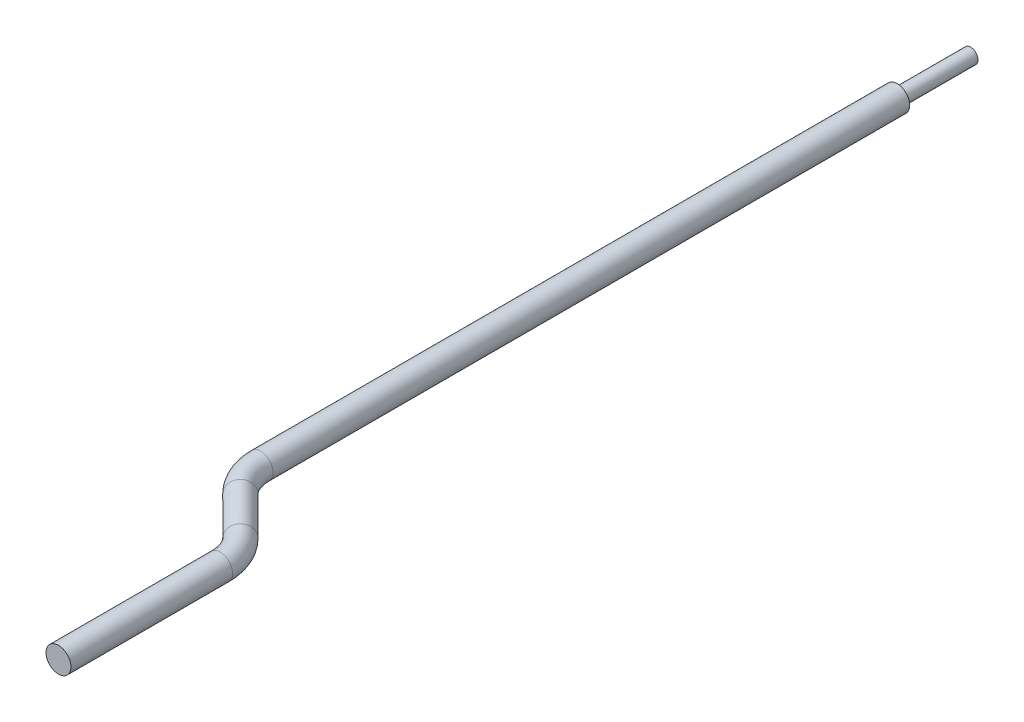
ISO-10303-21;
HEADER;
FILE_DESCRIPTION(('STEP AP214'),'2;1');
FILE_NAME('part.step','',(''),(''),'','','');
FILE_SCHEMA(('AUTOMOTIVE_DESIGN { 1 0 10303 214 1 1 1 1 }'));
ENDSEC;
DATA;
#1=APPLICATION_CONTEXT('core data for automotive mechanical design processes');
#2=APPLICATION_PROTOCOL_DEFINITION('international standard','automotive_design',2000,#1);
#3=PRODUCT_CONTEXT('',#1,'mechanical');
#4=PRODUCT('Part','Part','',(#3));
#5=PRODUCT_RELATED_PRODUCT_CATEGORY('part','',(#4));
#6=PRODUCT_DEFINITION_FORMATION('','',#4);
#7=PRODUCT_DEFINITION_CONTEXT('part definition',#1,'design');
#8=PRODUCT_DEFINITION('design','',#6,#7);
#9=PRODUCT_DEFINITION_SHAPE('','',#8);
#10=(LENGTH_UNIT() NAMED_UNIT(*) SI_UNIT(.MILLI.,.METRE.));
#11=(NAMED_UNIT(*) PLANE_ANGLE_UNIT() SI_UNIT($,.RADIAN.));
#12=(NAMED_UNIT(*) SI_UNIT($,.STERADIAN.) SOLID_ANGLE_UNIT());
#13=UNCERTAINTY_MEASURE_WITH_UNIT(LENGTH_MEASURE(1.E-05),#10,'distance_accuracy_value','');
#14=(GEOMETRIC_REPRESENTATION_CONTEXT(3) GLOBAL_UNCERTAINTY_ASSIGNED_CONTEXT((#13)) GLOBAL_UNIT_ASSIGNED_CONTEXT((#10,
#11,#12)) REPRESENTATION_CONTEXT('',''));
#15=CARTESIAN_POINT('',(0.,0.,0.));
#16=DIRECTION('',(0.,0.,1.));
#17=DIRECTION('',(1.,0.,0.));
#18=AXIS2_PLACEMENT_3D('',#15,#16,#17);
#19=CARTESIAN_POINT('',(0.,0.,35.56));
#20=DIRECTION('',(0.,0.,-1.));
#21=DIRECTION('',(-1.,0.,0.));
#22=AXIS2_PLACEMENT_3D('',#19,#20,#21);
#23=CYLINDRICAL_SURFACE('',#22,0.6477);
#24=CARTESIAN_POINT('',(0.,0.,36.83));
#25=DIRECTION('',(0.,0.,1.));
#26=DIRECTION('',(1.,0.,0.));
#27=AXIS2_PLACEMENT_3D('',#24,#25,#26);
#28=CIRCLE('',#27,0.6477);
#29=CARTESIAN_POINT('',(-0.647700000000005,0.,36.83));
#30=VERTEX_POINT('',#29);
#31=EDGE_CURVE('E49',#30,#30,#28,.T.);
#32=ORIENTED_EDGE('',*,*,#31,.F.);
#33=EDGE_LOOP('',(#32));
#34=FACE_BOUND('',#33,.T.);
#35=CARTESIAN_POINT('',(0.,0.,3.81));
#36=DIRECTION('',(0.,0.,-1.));
#37=DIRECTION('',(-1.,0.,0.));
#38=AXIS2_PLACEMENT_3D('',#35,#36,#37);
#39=CIRCLE('',#38,0.6477);
#40=CARTESIAN_POINT('',(-0.6477,0.,3.81));
#41=VERTEX_POINT('',#40);
#42=EDGE_CURVE('E56',#41,#41,#39,.T.);
#43=ORIENTED_EDGE('',*,*,#42,.F.);
#44=EDGE_LOOP('',(#43));
#45=FACE_BOUND('',#44,.T.);
#46=ADVANCED_FACE('F30',(#34,#45),#23,.T.);
#47=CARTESIAN_POINT('',(3.47980000000001,0.,42.4140048968553));
#48=DIRECTION('',(0.,0.,1.));
#49=DIRECTION('',(1.,0.,0.));
#50=AXIS2_PLACEMENT_3D('',#47,#48,#49);
#51=CYLINDRICAL_SURFACE('',#50,0.6477);
#52=CARTESIAN_POINT('',(3.47980000000001,0.,42.4140048968553));
#53=DIRECTION('',(0.,0.,1.));
#54=DIRECTION('',(1.,0.,0.));
#55=AXIS2_PLACEMENT_3D('',#52,#53,#54);
#56=CIRCLE('',#55,0.6477);
#57=CARTESIAN_POINT('',(4.1275,0.,42.4140048968553));
#58=VERTEX_POINT('',#57);
#59=EDGE_CURVE('E36',#58,#58,#56,.T.);
#60=ORIENTED_EDGE('',*,*,#59,.T.);
#61=EDGE_LOOP('',(#60));
#62=FACE_BOUND('',#61,.T.);
#63=CARTESIAN_POINT('',(3.4798,0.,50.8));
#64=DIRECTION('',(0.,0.,1.));
#65=DIRECTION('',(1.,0.,0.));
#66=AXIS2_PLACEMENT_3D('',#63,#64,#65);
#67=CIRCLE('',#66,0.6477);
#68=CARTESIAN_POINT('',(4.1275,0.,50.8));
#69=VERTEX_POINT('',#68);
#70=EDGE_CURVE('E10',#69,#69,#67,.T.);
#71=ORIENTED_EDGE('',*,*,#70,.F.);
#72=EDGE_LOOP('',(#71));
#73=FACE_BOUND('',#72,.T.);
#74=ADVANCED_FACE('F66',(#62,#73),#51,.T.);
#75=CARTESIAN_POINT('',(0.939800000000002,0.,42.4140048968553));
#76=DIRECTION('',(0.,-1.,0.));
#77=DIRECTION('',(0.,0.,-1.));
#78=AXIS2_PLACEMENT_3D('',#75,#76,#77);
#79=TOROIDAL_SURFACE('',#78,2.54,0.6477);
#80=CARTESIAN_POINT('',(2.73585122421383,0.,40.6179536726415));
#81=DIRECTION('',(0.707106781186549,0.,0.707106781186547));
#82=DIRECTION('',(0.707106781186547,0.,-0.707106781186549));
#83=AXIS2_PLACEMENT_3D('',#80,#81,#82);
#84=CIRCLE('',#83,0.6477);
#85=CARTESIAN_POINT('',(3.19384428638835,0.,40.159960610467));
#86=VERTEX_POINT('',#85);
#87=EDGE_CURVE('E40',#86,#86,#84,.T.);
#88=CARTESIAN_POINT('',(0.939800000000002,0.,42.4140048968553));
#89=DIRECTION('',(0.,-1.,0.));
#90=DIRECTION('',(0.,0.,-1.));
#91=AXIS2_PLACEMENT_3D('',#88,#89,#90);
#92=CIRCLE('',#91,3.1877);
#93=EDGE_CURVE('',#86,#58,#92,.T.);
#94=ORIENTED_EDGE('',*,*,#87,.T.);
#95=ORIENTED_EDGE('',*,*,#59,.F.);
#96=ORIENTED_EDGE('',*,*,#93,.T.);
#97=ORIENTED_EDGE('',*,*,#93,.F.);
#98=EDGE_LOOP('',(#94,#96,#95,#97));
#99=FACE_BOUND('',#98,.T.);
#100=ADVANCED_FACE('F71',(#99),#79,.T.);
#101=CARTESIAN_POINT('',(0.743948775786166,0.,38.6260512242138));
#102=DIRECTION('',(0.707106781186549,0.,0.707106781186546));
#103=DIRECTION('',(0.707106781186546,0.,-0.707106781186549));
#104=AXIS2_PLACEMENT_3D('',#101,#102,#103);
#105=CYLINDRICAL_SURFACE('',#104,0.6477);
#106=CARTESIAN_POINT('',(0.743948775786166,0.,38.6260512242138));
#107=DIRECTION('',(0.707106781186549,0.,0.707106781186547));
#108=DIRECTION('',(0.707106781186547,0.,-0.707106781186549));
#109=AXIS2_PLACEMENT_3D('',#106,#107,#108);
#110=CIRCLE('',#109,0.6477);
#111=CARTESIAN_POINT('',(0.28595571361164,0.,39.0840442863884));
#112=VERTEX_POINT('',#111);
#113=EDGE_CURVE('E44',#112,#112,#110,.T.);
#114=ORIENTED_EDGE('',*,*,#113,.T.);
#115=EDGE_LOOP('',(#114));
#116=FACE_BOUND('',#115,.T.);
#117=ORIENTED_EDGE('',*,*,#87,.F.);
#118=EDGE_LOOP('',(#117));
#119=FACE_BOUND('',#118,.T.);
#120=ADVANCED_FACE('F79',(#116,#119),#105,.T.);
#121=CARTESIAN_POINT('',(2.54,0.,36.83));
#122=DIRECTION('',(0.,1.,0.));
#123=DIRECTION('',(0.,0.,1.));
#124=AXIS2_PLACEMENT_3D('',#121,#122,#123);
#125=TOROIDAL_SURFACE('',#124,2.54,0.6477);
#126=CARTESIAN_POINT('',(2.54,0.,36.83));
#127=DIRECTION('',(0.,1.,0.));
#128=DIRECTION('',(0.,0.,1.));
#129=AXIS2_PLACEMENT_3D('',#126,#127,#128);
#130=CIRCLE('',#129,3.1877);
#131=EDGE_CURVE('',#30,#112,#130,.T.);
#132=ORIENTED_EDGE('',*,*,#31,.T.);
#133=ORIENTED_EDGE('',*,*,#113,.F.);
#134=ORIENTED_EDGE('',*,*,#131,.T.);
#135=ORIENTED_EDGE('',*,*,#131,.F.);
#136=EDGE_LOOP('',(#132,#134,#133,#135));
#137=FACE_BOUND('',#136,.T.);
#138=ADVANCED_FACE('F75',(#137),#125,.T.);
#139=CARTESIAN_POINT('',(3.4798,0.,50.8));
#140=DIRECTION('',(0.,0.,1.));
#141=DIRECTION('',(1.,0.,0.));
#142=AXIS2_PLACEMENT_3D('',#139,#140,#141);
#143=PLANE('',#142);
#144=ORIENTED_EDGE('',*,*,#70,.T.);
#145=EDGE_LOOP('',(#144));
#146=FACE_BOUND('',#145,.T.);
#147=ADVANCED_FACE('F78',(#146),#143,.T.);
#148=CARTESIAN_POINT('',(0.,0.,3.81));
#149=DIRECTION('',(0.,0.,-1.));
#150=DIRECTION('',(-1.,0.,0.));
#151=AXIS2_PLACEMENT_3D('',#148,#149,#150);
#152=CYLINDRICAL_SURFACE('',#151,0.381);
#153=CARTESIAN_POINT('',(0.,0.,3.81));
#154=DIRECTION('',(0.,0.,-1.));
#155=DIRECTION('',(-1.,0.,0.));
#156=AXIS2_PLACEMENT_3D('',#153,#154,#155);
#157=CIRCLE('',#156,0.381);
#158=CARTESIAN_POINT('',(-0.381,0.,3.81));
#159=VERTEX_POINT('',#158);
#160=EDGE_CURVE('E52',#159,#159,#157,.F.);
#161=ORIENTED_EDGE('',*,*,#160,.F.);
#162=EDGE_LOOP('',(#161));
#163=FACE_BOUND('',#162,.T.);
#164=CARTESIAN_POINT('',(0.,0.,0.));
#165=DIRECTION('',(0.,0.,-1.));
#166=DIRECTION('',(-1.,0.,0.));
#167=AXIS2_PLACEMENT_3D('',#164,#165,#166);
#168=CIRCLE('',#167,0.381);
#169=CARTESIAN_POINT('',(-0.381,0.,0.));
#170=VERTEX_POINT('',#169);
#171=EDGE_CURVE('E53',#170,#170,#168,.F.);
#172=ORIENTED_EDGE('',*,*,#171,.T.);
#173=EDGE_LOOP('',(#172));
#174=FACE_BOUND('',#173,.T.);
#175=ADVANCED_FACE('F99',(#163,#174),#152,.T.);
#176=CARTESIAN_POINT('',(0.,0.,3.81));
#177=DIRECTION('',(0.,0.,-1.));
#178=DIRECTION('',(-1.,0.,0.));
#179=AXIS2_PLACEMENT_3D('',#176,#177,#178);
#180=PLANE('',#179);
#181=ORIENTED_EDGE('',*,*,#42,.T.);
#182=EDGE_LOOP('',(#181));
#183=FACE_BOUND('',#182,.T.);
#184=ORIENTED_EDGE('',*,*,#160,.T.);
#185=EDGE_LOOP('',(#184));
#186=FACE_BOUND('',#185,.T.);
#187=ADVANCED_FACE('F62',(#183,#186),#180,.T.);
#188=CARTESIAN_POINT('',(0.,0.,0.));
#189=DIRECTION('',(0.,0.,1.));
#190=DIRECTION('',(1.,0.,0.));
#191=AXIS2_PLACEMENT_3D('',#188,#189,#190);
#192=PLANE('',#191);
#193=ORIENTED_EDGE('',*,*,#171,.F.);
#194=EDGE_LOOP('',(#193));
#195=FACE_BOUND('',#194,.T.);
#196=ADVANCED_FACE('F93',(#195),#192,.F.);
#197=CLOSED_SHELL('',(#46,#74,#100,#120,#138,#147,#175,#187,#196));
#198=MANIFOLD_SOLID_BREP('B2',#197);
#199=ADVANCED_BREP_SHAPE_REPRESENTATION('',(#18,#198),#14);
#200=SHAPE_DEFINITION_REPRESENTATION(#9,#199);
ENDSEC;
END-ISO-10303-21;
